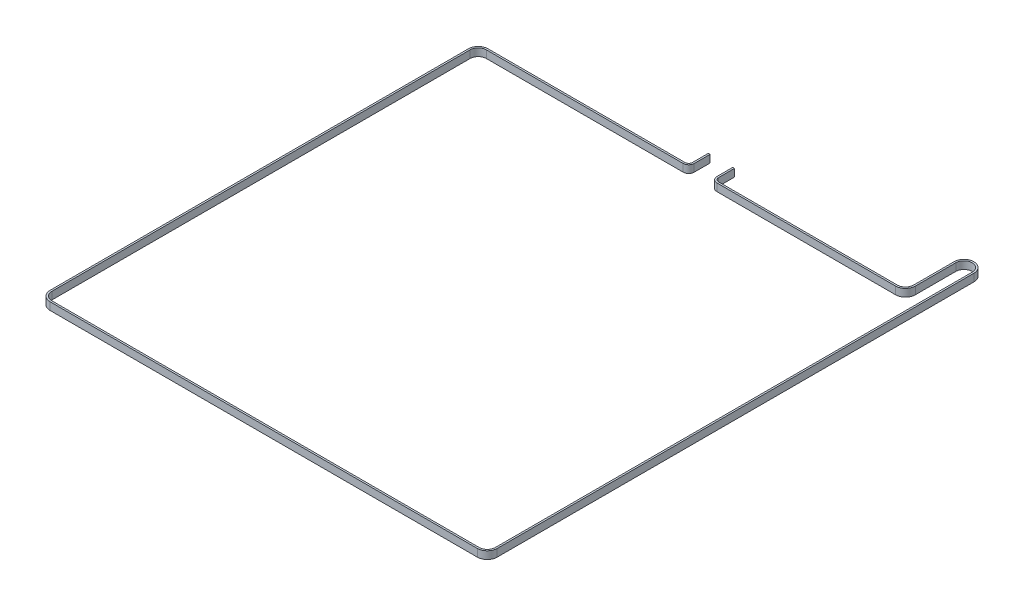
ISO-10303-21;
HEADER;
FILE_DESCRIPTION(('STEP AP214'),'2;1');
FILE_NAME('part.step','',(''),(''),'','','');
FILE_SCHEMA(('AUTOMOTIVE_DESIGN { 1 0 10303 214 1 1 1 1 }'));
ENDSEC;
DATA;
#1=APPLICATION_CONTEXT('core data for automotive mechanical design processes');
#2=APPLICATION_PROTOCOL_DEFINITION('international standard','automotive_design',2000,#1);
#3=PRODUCT_CONTEXT('',#1,'mechanical');
#4=PRODUCT('Part','Part','',(#3));
#5=PRODUCT_RELATED_PRODUCT_CATEGORY('part','',(#4));
#6=PRODUCT_DEFINITION_FORMATION('','',#4);
#7=PRODUCT_DEFINITION_CONTEXT('part definition',#1,'design');
#8=PRODUCT_DEFINITION('design','',#6,#7);
#9=PRODUCT_DEFINITION_SHAPE('','',#8);
#10=(LENGTH_UNIT() NAMED_UNIT(*) SI_UNIT(.MILLI.,.METRE.));
#11=(NAMED_UNIT(*) PLANE_ANGLE_UNIT() SI_UNIT($,.RADIAN.));
#12=(NAMED_UNIT(*) SI_UNIT($,.STERADIAN.) SOLID_ANGLE_UNIT());
#13=UNCERTAINTY_MEASURE_WITH_UNIT(LENGTH_MEASURE(1.E-05),#10,'distance_accuracy_value','');
#14=(GEOMETRIC_REPRESENTATION_CONTEXT(3) GLOBAL_UNCERTAINTY_ASSIGNED_CONTEXT((#13)) GLOBAL_UNIT_ASSIGNED_CONTEXT((#10,
#11,#12)) REPRESENTATION_CONTEXT('',''));
#15=CARTESIAN_POINT('',(0.,0.,0.));
#16=DIRECTION('',(0.,0.,1.));
#17=DIRECTION('',(1.,0.,0.));
#18=AXIS2_PLACEMENT_3D('',#15,#16,#17);
#19=CARTESIAN_POINT('',(-8.97001004794294,-10.0000457504828,119.964412949688));
#20=DIRECTION('',(-6.17863248487036E-13,0.,-1.));
#21=DIRECTION('',(-1.,0.,6.17863248487036E-13));
#22=AXIS2_PLACEMENT_3D('',#19,#20,#21);
#23=PLANE('',#22);
#24=DIRECTION('',(0.,1.,0.));
#25=VECTOR('',#24,1.);
#26=CARTESIAN_POINT('',(-8.97001004793502,-10.0000457504828,119.964412949688));
#27=LINE('',#26,#25);
#28=CARTESIAN_POINT('',(-8.97001004793766,-13.0000457504828,119.964412949688));
#29=VERTEX_POINT('',#28);
#30=CARTESIAN_POINT('',(-8.97001004793766,-7.0000457504828,119.964412949688));
#31=VERTEX_POINT('',#30);
#32=EDGE_CURVE('E314',#29,#31,#27,.T.);
#33=ORIENTED_EDGE('',*,*,#32,.F.);
#34=DIRECTION('',(-1.,0.,6.17863248487036E-13));
#35=VECTOR('',#34,1.);
#36=CARTESIAN_POINT('',(-8.97001004794294,-13.0000457504828,119.964412949688));
#37=LINE('',#36,#35);
#38=CARTESIAN_POINT('',(-10.350010047943,-13.0000457504828,119.964412949689));
#39=VERTEX_POINT('',#38);
#40=EDGE_CURVE('E345',#29,#39,#37,.T.);
#41=ORIENTED_EDGE('',*,*,#40,.T.);
#42=DIRECTION('',(0.,1.,0.));
#43=VECTOR('',#42,1.);
#44=CARTESIAN_POINT('',(-10.350010047943,-10.0000457504828,119.964412949689));
#45=LINE('',#44,#43);
#46=CARTESIAN_POINT('',(-10.350010047943,-7.0000457504828,119.964412949689));
#47=VERTEX_POINT('',#46);
#48=EDGE_CURVE('E311',#47,#39,#45,.F.);
#49=ORIENTED_EDGE('',*,*,#48,.F.);
#50=DIRECTION('',(-1.,0.,6.17863248487036E-13));
#51=VECTOR('',#50,1.);
#52=CARTESIAN_POINT('',(-8.97001004794294,-7.0000457504828,119.964412949688));
#53=LINE('',#52,#51);
#54=EDGE_CURVE('E353',#47,#31,#53,.F.);
#55=ORIENTED_EDGE('',*,*,#54,.T.);
#56=EDGE_LOOP('',(#33,#41,#49,#55));
#57=FACE_BOUND('',#56,.T.);
#58=ADVANCED_FACE('F17',(#57),#23,.T.);
#59=CARTESIAN_POINT('',(10.3499987045161,-10.0000457504828,119.964412949689));
#60=DIRECTION('',(-6.17863248487044E-13,0.,-1.));
#61=DIRECTION('',(-1.,0.,6.17863248487044E-13));
#62=AXIS2_PLACEMENT_3D('',#59,#60,#61);
#63=PLANE('',#62);
#64=DIRECTION('',(0.,1.,0.));
#65=VECTOR('',#64,1.);
#66=CARTESIAN_POINT('',(10.3499987045159,-10.0000457504828,119.964412949689));
#67=LINE('',#66,#65);
#68=CARTESIAN_POINT('',(10.3499987045185,-13.0000457504828,119.964412949689));
#69=VERTEX_POINT('',#68);
#70=CARTESIAN_POINT('',(10.3499987045185,-7.0000457504828,119.964412949689));
#71=VERTEX_POINT('',#70);
#72=EDGE_CURVE('E267',#69,#71,#67,.T.);
#73=ORIENTED_EDGE('',*,*,#72,.F.);
#74=DIRECTION('',(-1.,0.,6.17863248487044E-13));
#75=VECTOR('',#74,1.);
#76=CARTESIAN_POINT('',(10.3499987045161,-13.0000457504828,119.964412949689));
#77=LINE('',#76,#75);
#78=CARTESIAN_POINT('',(8.96999870451613,-13.0000457504828,119.96441294969));
#79=VERTEX_POINT('',#78);
#80=EDGE_CURVE('E336',#69,#79,#77,.T.);
#81=ORIENTED_EDGE('',*,*,#80,.T.);
#82=DIRECTION('',(0.,1.,0.));
#83=VECTOR('',#82,1.);
#84=CARTESIAN_POINT('',(8.96999870451621,-10.0000457504828,119.96441294969));
#85=LINE('',#84,#83);
#86=CARTESIAN_POINT('',(8.96999870451613,-7.0000457504828,119.96441294969));
#87=VERTEX_POINT('',#86);
#88=EDGE_CURVE('E263',#87,#79,#85,.F.);
#89=ORIENTED_EDGE('',*,*,#88,.F.);
#90=DIRECTION('',(-1.,0.,6.17863248487044E-13));
#91=VECTOR('',#90,1.);
#92=CARTESIAN_POINT('',(10.3499987045161,-7.0000457504828,119.964412949689));
#93=LINE('',#92,#91);
#94=EDGE_CURVE('E342',#87,#71,#93,.F.);
#95=ORIENTED_EDGE('',*,*,#94,.T.);
#96=EDGE_LOOP('',(#73,#81,#89,#95));
#97=FACE_BOUND('',#96,.T.);
#98=ADVANCED_FACE('F696',(#97),#63,.T.);
#99=CARTESIAN_POINT('',(-169.379997232066,-10.0000457504828,475.000000000022));
#100=DIRECTION('',(0.,1.,0.));
#101=DIRECTION('',(0.,0.,1.));
#102=AXIS2_PLACEMENT_3D('',#99,#100,#101);
#103=CYLINDRICAL_SURFACE('',#102,6.49999999999999);
#104=CARTESIAN_POINT('',(-169.379997232066,-7.0000457504828,475.000000000022));
#105=DIRECTION('',(0.,1.,0.));
#106=DIRECTION('',(0.,0.,1.));
#107=AXIS2_PLACEMENT_3D('',#104,#105,#106);
#108=CIRCLE('',#107,6.49999999999999);
#109=CARTESIAN_POINT('',(-169.379997232066,-7.0000457504828,481.500000000022));
#110=VERTEX_POINT('',#109);
#111=CARTESIAN_POINT('',(-175.879997232066,-7.0000457504828,475.000000000022));
#112=VERTEX_POINT('',#111);
#113=EDGE_CURVE('E437',#110,#112,#108,.F.);
#114=ORIENTED_EDGE('',*,*,#113,.F.);
#115=DIRECTION('',(0.,1.,0.));
#116=VECTOR('',#115,1.);
#117=CARTESIAN_POINT('',(-169.379997232066,-10.0000457504828,481.500000000022));
#118=LINE('',#117,#116);
#119=CARTESIAN_POINT('',(-169.379997232066,-13.0000457504828,481.500000000022));
#120=VERTEX_POINT('',#119);
#121=EDGE_CURVE('E241',#120,#110,#118,.T.);
#122=ORIENTED_EDGE('',*,*,#121,.F.);
#123=CARTESIAN_POINT('',(-169.379997232066,-13.0000457504828,475.000000000022));
#124=DIRECTION('',(0.,1.,0.));
#125=DIRECTION('',(0.,0.,1.));
#126=AXIS2_PLACEMENT_3D('',#123,#124,#125);
#127=CIRCLE('',#126,6.49999999999999);
#128=CARTESIAN_POINT('',(-175.879997232066,-13.0000457504828,475.000000000022));
#129=VERTEX_POINT('',#128);
#130=EDGE_CURVE('E402',#120,#129,#127,.F.);
#131=ORIENTED_EDGE('',*,*,#130,.T.);
#132=DIRECTION('',(0.,1.,0.));
#133=VECTOR('',#132,1.);
#134=CARTESIAN_POINT('',(-175.879997232066,-10.0000457504828,475.000000000022));
#135=LINE('',#134,#133);
#136=EDGE_CURVE('E334',#112,#129,#135,.F.);
#137=ORIENTED_EDGE('',*,*,#136,.F.);
#138=EDGE_LOOP('',(#114,#122,#131,#137));
#139=FACE_BOUND('',#138,.T.);
#140=ADVANCED_FACE('F693',(#139),#103,.F.);
#141=CARTESIAN_POINT('',(-175.879997232066,-10.0000457504828,475.000000000022));
#142=DIRECTION('',(1.,0.,3.15670613145116E-09));
#143=DIRECTION('',(3.15670613145116E-09,0.,-1.));
#144=AXIS2_PLACEMENT_3D('',#141,#142,#143);
#145=PLANE('',#144);
#146=ORIENTED_EDGE('',*,*,#136,.T.);
#147=DIRECTION('',(0.,0.,1.));
#148=VECTOR('',#147,1.);
#149=CARTESIAN_POINT('',(-175.879997232066,-13.0000457504828,280.999999998365));
#150=LINE('',#149,#148);
#151=CARTESIAN_POINT('',(-175.879996708684,-13.0000457504828,143.400003433195));
#152=VERTEX_POINT('',#151);
#153=EDGE_CURVE('E401',#129,#152,#150,.F.);
#154=ORIENTED_EDGE('',*,*,#153,.T.);
#155=DIRECTION('',(0.,1.,0.));
#156=VECTOR('',#155,1.);
#157=CARTESIAN_POINT('',(-175.879996185302,-10.0000457504828,143.400003433195));
#158=LINE('',#157,#156);
#159=CARTESIAN_POINT('',(-175.879996708684,-7.0000457504828,143.400003433195));
#160=VERTEX_POINT('',#159);
#161=EDGE_CURVE('E331',#152,#160,#158,.T.);
#162=ORIENTED_EDGE('',*,*,#161,.T.);
#163=DIRECTION('',(0.,0.,1.));
#164=VECTOR('',#163,1.);
#165=CARTESIAN_POINT('',(-175.879997232066,-7.0000457504828,280.999999998365));
#166=LINE('',#165,#164);
#167=EDGE_CURVE('E436',#112,#160,#166,.F.);
#168=ORIENTED_EDGE('',*,*,#167,.F.);
#169=EDGE_LOOP('',(#146,#154,#162,#168));
#170=FACE_BOUND('',#169,.T.);
#171=ADVANCED_FACE('F689',(#170),#145,.T.);
#172=CARTESIAN_POINT('',(-169.379996185302,-10.0000457504828,143.400003433195));
#173=DIRECTION('',(0.,1.,0.));
#174=DIRECTION('',(0.,0.,1.));
#175=AXIS2_PLACEMENT_3D('',#172,#173,#174);
#176=CYLINDRICAL_SURFACE('',#175,6.49999999999999);
#177=CARTESIAN_POINT('',(-169.379996185302,-7.0000457504828,143.400003433195));
#178=DIRECTION('',(0.,1.,0.));
#179=DIRECTION('',(0.,0.,1.));
#180=AXIS2_PLACEMENT_3D('',#177,#178,#179);
#181=CIRCLE('',#180,6.49999999999999);
#182=CARTESIAN_POINT('',(-169.379996185302,-7.0000457504828,136.900003433195));
#183=VERTEX_POINT('',#182);
#184=EDGE_CURVE('E432',#160,#183,#181,.F.);
#185=ORIENTED_EDGE('',*,*,#184,.F.);
#186=ORIENTED_EDGE('',*,*,#161,.F.);
#187=CARTESIAN_POINT('',(-169.379996185302,-13.0000457504828,143.400003433195));
#188=DIRECTION('',(0.,1.,0.));
#189=DIRECTION('',(0.,0.,1.));
#190=AXIS2_PLACEMENT_3D('',#187,#188,#189);
#191=CIRCLE('',#190,6.49999999999999);
#192=CARTESIAN_POINT('',(-169.379996185302,-13.0000457504828,136.900003433195));
#193=VERTEX_POINT('',#192);
#194=EDGE_CURVE('E398',#152,#193,#191,.F.);
#195=ORIENTED_EDGE('',*,*,#194,.T.);
#196=DIRECTION('',(0.,1.,0.));
#197=VECTOR('',#196,1.);
#198=CARTESIAN_POINT('',(-169.379996185302,-10.0000457504828,136.900003433195));
#199=LINE('',#198,#197);
#200=EDGE_CURVE('E327',#183,#193,#199,.F.);
#201=ORIENTED_EDGE('',*,*,#200,.F.);
#202=EDGE_LOOP('',(#185,#186,#195,#201));
#203=FACE_BOUND('',#202,.T.);
#204=ADVANCED_FACE('F685',(#203),#176,.F.);
#205=CARTESIAN_POINT('',(-169.379996185302,-10.0000457504828,136.900003433195));
#206=DIRECTION('',(0.,0.,1.));
#207=DIRECTION('',(1.,0.,0.));
#208=AXIS2_PLACEMENT_3D('',#205,#206,#207);
#209=PLANE('',#208);
#210=ORIENTED_EDGE('',*,*,#200,.T.);
#211=DIRECTION('',(1.,0.,0.));
#212=VECTOR('',#211,1.);
#213=CARTESIAN_POINT('',(7.23360926713212E-09,-13.0000457504828,136.900003433195));
#214=LINE('',#213,#212);
#215=CARTESIAN_POINT('',(-13.350010047935,-13.0000457504828,136.900003433195));
#216=VERTEX_POINT('',#215);
#217=EDGE_CURVE('E397',#193,#216,#214,.T.);
#218=ORIENTED_EDGE('',*,*,#217,.T.);
#219=DIRECTION('',(0.,1.,0.));
#220=VECTOR('',#219,1.);
#221=CARTESIAN_POINT('',(-13.350010047935,-10.0000457504828,136.900003433195));
#222=LINE('',#221,#220);
#223=CARTESIAN_POINT('',(-13.350010047935,-7.0000457504828,136.900003433195));
#224=VERTEX_POINT('',#223);
#225=EDGE_CURVE('E320',#224,#216,#222,.F.);
#226=ORIENTED_EDGE('',*,*,#225,.F.);
#227=DIRECTION('',(1.,0.,0.));
#228=VECTOR('',#227,1.);
#229=CARTESIAN_POINT('',(7.23360926713212E-09,-7.0000457504828,136.900003433195));
#230=LINE('',#229,#228);
#231=EDGE_CURVE('E431',#183,#224,#230,.T.);
#232=ORIENTED_EDGE('',*,*,#231,.F.);
#233=EDGE_LOOP('',(#210,#218,#226,#232));
#234=FACE_BOUND('',#233,.T.);
#235=ADVANCED_FACE('F681',(#234),#209,.T.);
#236=CARTESIAN_POINT('',(-13.350010047935,-10.0000457504828,132.520003433195));
#237=DIRECTION('',(0.,1.,0.));
#238=DIRECTION('',(0.,0.,1.));
#239=AXIS2_PLACEMENT_3D('',#236,#237,#238);
#240=CYLINDRICAL_SURFACE('',#239,4.38);
#241=CARTESIAN_POINT('',(-13.350010047935,-13.0000457504828,132.520003433195));
#242=DIRECTION('',(0.,1.,0.));
#243=DIRECTION('',(0.,0.,1.));
#244=AXIS2_PLACEMENT_3D('',#241,#242,#243);
#245=CIRCLE('',#244,4.38);
#246=CARTESIAN_POINT('',(-8.97001004793502,-13.0000457504828,132.520003433195));
#247=VERTEX_POINT('',#246);
#248=EDGE_CURVE('E394',#216,#247,#245,.T.);
#249=ORIENTED_EDGE('',*,*,#248,.T.);
#250=DIRECTION('',(0.,1.,0.));
#251=VECTOR('',#250,1.);
#252=CARTESIAN_POINT('',(-8.97001004793502,-10.0000457504828,132.520003433195));
#253=LINE('',#252,#251);
#254=CARTESIAN_POINT('',(-8.97001004793502,-7.0000457504828,132.520003433195));
#255=VERTEX_POINT('',#254);
#256=EDGE_CURVE('E317',#255,#247,#253,.F.);
#257=ORIENTED_EDGE('',*,*,#256,.F.);
#258=CARTESIAN_POINT('',(-13.350010047935,-7.0000457504828,132.520003433195));
#259=DIRECTION('',(0.,1.,0.));
#260=DIRECTION('',(0.,0.,1.));
#261=AXIS2_PLACEMENT_3D('',#258,#259,#260);
#262=CIRCLE('',#261,4.38);
#263=EDGE_CURVE('E427',#224,#255,#262,.T.);
#264=ORIENTED_EDGE('',*,*,#263,.F.);
#265=ORIENTED_EDGE('',*,*,#225,.T.);
#266=EDGE_LOOP('',(#249,#257,#264,#265));
#267=FACE_BOUND('',#266,.T.);
#268=ADVANCED_FACE('F677',(#267),#240,.T.);
#269=CARTESIAN_POINT('',(-8.97001004793502,-10.0000457504828,136.900003433195));
#270=DIRECTION('',(1.,0.,0.));
#271=DIRECTION('',(0.,0.,-1.));
#272=AXIS2_PLACEMENT_3D('',#269,#270,#271);
#273=PLANE('',#272);
#274=ORIENTED_EDGE('',*,*,#32,.T.);
#275=DIRECTION('',(0.,0.,1.));
#276=VECTOR('',#275,1.);
#277=CARTESIAN_POINT('',(-8.97001004793502,-7.0000457504828,280.999999998365));
#278=LINE('',#277,#276);
#279=EDGE_CURVE('E430',#255,#31,#278,.F.);
#280=ORIENTED_EDGE('',*,*,#279,.F.);
#281=ORIENTED_EDGE('',*,*,#256,.T.);
#282=DIRECTION('',(0.,0.,1.));
#283=VECTOR('',#282,1.);
#284=CARTESIAN_POINT('',(-8.97001004793502,-13.0000457504828,280.999999998365));
#285=LINE('',#284,#283);
#286=EDGE_CURVE('E396',#247,#29,#285,.F.);
#287=ORIENTED_EDGE('',*,*,#286,.T.);
#288=EDGE_LOOP('',(#274,#280,#281,#287));
#289=FACE_BOUND('',#288,.T.);
#290=ADVANCED_FACE('F673',(#289),#273,.T.);
#291=CARTESIAN_POINT('',(-10.350010047943,-10.0000457504828,119.964412949689));
#292=DIRECTION('',(-1.,0.,5.93201140262421E-13));
#293=DIRECTION('',(5.93201140262421E-13,0.,1.));
#294=AXIS2_PLACEMENT_3D('',#291,#292,#293);
#295=PLANE('',#294);
#296=ORIENTED_EDGE('',*,*,#48,.T.);
#297=DIRECTION('',(0.,0.,1.));
#298=VECTOR('',#297,1.);
#299=CARTESIAN_POINT('',(-10.350010047943,-13.0000457504828,280.999999998365));
#300=LINE('',#299,#298);
#301=CARTESIAN_POINT('',(-10.3500100479393,-13.0000457504828,132.520003433194));
#302=VERTEX_POINT('',#301);
#303=EDGE_CURVE('E393',#39,#302,#300,.T.);
#304=ORIENTED_EDGE('',*,*,#303,.T.);
#305=DIRECTION('',(0.,1.,0.));
#306=VECTOR('',#305,1.);
#307=CARTESIAN_POINT('',(-10.3500100479355,-10.0000457504828,132.520003433193));
#308=LINE('',#307,#306);
#309=CARTESIAN_POINT('',(-10.3500100479393,-7.0000457504828,132.520003433194));
#310=VERTEX_POINT('',#309);
#311=EDGE_CURVE('E309',#302,#310,#308,.T.);
#312=ORIENTED_EDGE('',*,*,#311,.T.);
#313=DIRECTION('',(0.,0.,1.));
#314=VECTOR('',#313,1.);
#315=CARTESIAN_POINT('',(-10.350010047943,-7.0000457504828,280.999999998365));
#316=LINE('',#315,#314);
#317=EDGE_CURVE('E426',#47,#310,#316,.T.);
#318=ORIENTED_EDGE('',*,*,#317,.F.);
#319=EDGE_LOOP('',(#296,#304,#312,#318));
#320=FACE_BOUND('',#319,.T.);
#321=ADVANCED_FACE('F669',(#320),#295,.T.);
#322=CARTESIAN_POINT('',(-13.3500100479355,-10.0000457504828,132.520003433195));
#323=DIRECTION('',(0.,1.,0.));
#324=DIRECTION('',(0.,0.,1.));
#325=AXIS2_PLACEMENT_3D('',#322,#323,#324);
#326=CYLINDRICAL_SURFACE('',#325,3.);
#327=DIRECTION('',(0.,1.,0.));
#328=VECTOR('',#327,1.);
#329=CARTESIAN_POINT('',(-13.3500100479355,-10.0000457504828,135.520003433195));
#330=LINE('',#329,#328);
#331=CARTESIAN_POINT('',(-13.3500100479355,-7.0000457504828,135.520003433195));
#332=VERTEX_POINT('',#331);
#333=CARTESIAN_POINT('',(-13.3500100479355,-13.0000457504828,135.520003433195));
#334=VERTEX_POINT('',#333);
#335=EDGE_CURVE('E306',#332,#334,#330,.F.);
#336=ORIENTED_EDGE('',*,*,#335,.F.);
#337=CARTESIAN_POINT('',(-13.3500100479355,-7.0000457504828,132.520003433195));
#338=DIRECTION('',(0.,1.,0.));
#339=DIRECTION('',(0.,0.,1.));
#340=AXIS2_PLACEMENT_3D('',#337,#338,#339);
#341=CIRCLE('',#340,3.);
#342=EDGE_CURVE('E423',#310,#332,#341,.F.);
#343=ORIENTED_EDGE('',*,*,#342,.F.);
#344=ORIENTED_EDGE('',*,*,#311,.F.);
#345=CARTESIAN_POINT('',(-13.3500100479355,-13.0000457504828,132.520003433195));
#346=DIRECTION('',(0.,1.,0.));
#347=DIRECTION('',(0.,0.,1.));
#348=AXIS2_PLACEMENT_3D('',#345,#346,#347);
#349=CIRCLE('',#348,3.);
#350=EDGE_CURVE('E391',#302,#334,#349,.F.);
#351=ORIENTED_EDGE('',*,*,#350,.T.);
#352=EDGE_LOOP('',(#336,#343,#344,#351));
#353=FACE_BOUND('',#352,.T.);
#354=ADVANCED_FACE('F665',(#353),#326,.F.);
#355=CARTESIAN_POINT('',(-10.3500100479338,-10.0000457504828,135.520003433195));
#356=DIRECTION('',(0.,0.,-1.));
#357=DIRECTION('',(-1.,0.,0.));
#358=AXIS2_PLACEMENT_3D('',#355,#356,#357);
#359=PLANE('',#358);
#360=DIRECTION('',(0.,1.,0.));
#361=VECTOR('',#360,1.);
#362=CARTESIAN_POINT('',(-169.379996185302,-10.0000457504828,135.520003433195));
#363=LINE('',#362,#361);
#364=CARTESIAN_POINT('',(-169.379996185302,-7.0000457504828,135.520003433195));
#365=VERTEX_POINT('',#364);
#366=CARTESIAN_POINT('',(-169.379996185302,-13.0000457504828,135.520003433195));
#367=VERTEX_POINT('',#366);
#368=EDGE_CURVE('E302',#365,#367,#363,.F.);
#369=ORIENTED_EDGE('',*,*,#368,.F.);
#370=DIRECTION('',(1.,0.,0.));
#371=VECTOR('',#370,1.);
#372=CARTESIAN_POINT('',(7.23360926713212E-09,-7.0000457504828,135.520003433195));
#373=LINE('',#372,#371);
#374=EDGE_CURVE('E422',#332,#365,#373,.F.);
#375=ORIENTED_EDGE('',*,*,#374,.F.);
#376=ORIENTED_EDGE('',*,*,#335,.T.);
#377=DIRECTION('',(1.,0.,0.));
#378=VECTOR('',#377,1.);
#379=CARTESIAN_POINT('',(7.23360926713212E-09,-13.0000457504828,135.520003433195));
#380=LINE('',#379,#378);
#381=EDGE_CURVE('E390',#334,#367,#380,.F.);
#382=ORIENTED_EDGE('',*,*,#381,.T.);
#383=EDGE_LOOP('',(#369,#375,#376,#382));
#384=FACE_BOUND('',#383,.T.);
#385=ADVANCED_FACE('F661',(#384),#359,.T.);
#386=CARTESIAN_POINT('',(-169.379996185302,-10.0000457504828,143.400003433195));
#387=DIRECTION('',(0.,1.,0.));
#388=DIRECTION('',(0.,0.,1.));
#389=AXIS2_PLACEMENT_3D('',#386,#387,#388);
#390=CYLINDRICAL_SURFACE('',#389,7.87999999999997);
#391=ORIENTED_EDGE('',*,*,#368,.T.);
#392=CARTESIAN_POINT('',(-169.379996185302,-13.0000457504828,143.400003433195));
#393=DIRECTION('',(0.,1.,0.));
#394=DIRECTION('',(0.,0.,1.));
#395=AXIS2_PLACEMENT_3D('',#392,#393,#394);
#396=CIRCLE('',#395,7.87999999999997);
#397=CARTESIAN_POINT('',(-177.259996185302,-13.0000457504828,143.400003420758));
#398=VERTEX_POINT('',#397);
#399=EDGE_CURVE('E387',#367,#398,#396,.T.);
#400=ORIENTED_EDGE('',*,*,#399,.T.);
#401=DIRECTION('',(0.,1.,0.));
#402=VECTOR('',#401,1.);
#403=CARTESIAN_POINT('',(-177.259996185302,-10.0000457504828,143.40000340832));
#404=LINE('',#403,#402);
#405=CARTESIAN_POINT('',(-177.259996185302,-7.0000457504828,143.400003420758));
#406=VERTEX_POINT('',#405);
#407=EDGE_CURVE('E298',#406,#398,#404,.F.);
#408=ORIENTED_EDGE('',*,*,#407,.F.);
#409=CARTESIAN_POINT('',(-169.379996185302,-7.0000457504828,143.400003433195));
#410=DIRECTION('',(0.,1.,0.));
#411=DIRECTION('',(0.,0.,1.));
#412=AXIS2_PLACEMENT_3D('',#409,#410,#411);
#413=CIRCLE('',#412,7.87999999999997);
#414=EDGE_CURVE('E418',#365,#406,#413,.T.);
#415=ORIENTED_EDGE('',*,*,#414,.F.);
#416=EDGE_LOOP('',(#391,#400,#408,#415));
#417=FACE_BOUND('',#416,.T.);
#418=ADVANCED_FACE('F657',(#417),#390,.T.);
#419=CARTESIAN_POINT('',(-177.259996185302,-10.0000457504828,143.40000340832));
#420=DIRECTION('',(-1.,0.,-3.15670613145116E-09));
#421=DIRECTION('',(-3.15670613145116E-09,0.,1.));
#422=AXIS2_PLACEMENT_3D('',#419,#420,#421);
#423=PLANE('',#422);
#424=ORIENTED_EDGE('',*,*,#407,.T.);
#425=DIRECTION('',(0.,0.,1.));
#426=VECTOR('',#425,1.);
#427=CARTESIAN_POINT('',(-177.259996185302,-13.0000457504828,280.999999998365));
#428=LINE('',#427,#426);
#429=CARTESIAN_POINT('',(-177.259996708684,-13.0000457504828,474.999999987584));
#430=VERTEX_POINT('',#429);
#431=EDGE_CURVE('E386',#398,#430,#428,.T.);
#432=ORIENTED_EDGE('',*,*,#431,.T.);
#433=DIRECTION('',(0.,1.,0.));
#434=VECTOR('',#433,1.);
#435=CARTESIAN_POINT('',(-177.259997232066,-10.0000457504828,474.999999975147));
#436=LINE('',#435,#434);
#437=CARTESIAN_POINT('',(-177.259996708684,-7.0000457504828,474.999999987584));
#438=VERTEX_POINT('',#437);
#439=EDGE_CURVE('E295',#438,#430,#436,.F.);
#440=ORIENTED_EDGE('',*,*,#439,.F.);
#441=DIRECTION('',(0.,0.,1.));
#442=VECTOR('',#441,1.);
#443=CARTESIAN_POINT('',(-177.259996185302,-7.0000457504828,280.999999998365));
#444=LINE('',#443,#442);
#445=EDGE_CURVE('E417',#406,#438,#444,.T.);
#446=ORIENTED_EDGE('',*,*,#445,.F.);
#447=EDGE_LOOP('',(#424,#432,#440,#446));
#448=FACE_BOUND('',#447,.T.);
#449=ADVANCED_FACE('F653',(#448),#423,.T.);
#450=CARTESIAN_POINT('',(-169.379997232066,-10.0000457504828,475.000000000022));
#451=DIRECTION('',(0.,1.,0.));
#452=DIRECTION('',(0.,0.,1.));
#453=AXIS2_PLACEMENT_3D('',#450,#451,#452);
#454=CYLINDRICAL_SURFACE('',#453,7.87999999999997);
#455=ORIENTED_EDGE('',*,*,#439,.T.);
#456=CARTESIAN_POINT('',(-169.379997232066,-13.0000457504828,475.000000000022));
#457=DIRECTION('',(0.,1.,0.));
#458=DIRECTION('',(0.,0.,1.));
#459=AXIS2_PLACEMENT_3D('',#456,#457,#458);
#460=CIRCLE('',#459,7.87999999999997);
#461=CARTESIAN_POINT('',(-169.379997232066,-13.0000457504828,482.880000000022));
#462=VERTEX_POINT('',#461);
#463=EDGE_CURVE('E384',#430,#462,#460,.T.);
#464=ORIENTED_EDGE('',*,*,#463,.T.);
#465=DIRECTION('',(0.,1.,0.));
#466=VECTOR('',#465,1.);
#467=CARTESIAN_POINT('',(-169.379997232066,-10.0000457504828,482.880000000022));
#468=LINE('',#467,#466);
#469=CARTESIAN_POINT('',(-169.379997232066,-7.0000457504828,482.880000000022));
#470=VERTEX_POINT('',#469);
#471=EDGE_CURVE('E292',#470,#462,#468,.F.);
#472=ORIENTED_EDGE('',*,*,#471,.F.);
#473=CARTESIAN_POINT('',(-169.379997232066,-7.0000457504828,475.000000000022));
#474=DIRECTION('',(0.,1.,0.));
#475=DIRECTION('',(0.,0.,1.));
#476=AXIS2_PLACEMENT_3D('',#473,#474,#475);
#477=CIRCLE('',#476,7.87999999999997);
#478=EDGE_CURVE('E414',#438,#470,#477,.T.);
#479=ORIENTED_EDGE('',*,*,#478,.F.);
#480=EDGE_LOOP('',(#455,#464,#472,#479));
#481=FACE_BOUND('',#480,.T.);
#482=ADVANCED_FACE('F649',(#481),#454,.T.);
#483=CARTESIAN_POINT('',(-169.379997232066,-10.0000457504828,482.880000000022));
#484=DIRECTION('',(0.,0.,1.));
#485=DIRECTION('',(1.,0.,0.));
#486=AXIS2_PLACEMENT_3D('',#483,#484,#485);
#487=PLANE('',#486);
#488=ORIENTED_EDGE('',*,*,#471,.T.);
#489=DIRECTION('',(1.,0.,0.));
#490=VECTOR('',#489,1.);
#491=CARTESIAN_POINT('',(7.23360926713212E-09,-13.0000457504828,482.880000000022));
#492=LINE('',#491,#490);
#493=CARTESIAN_POINT('',(169.379997246531,-13.0000457504828,482.880000000022));
#494=VERTEX_POINT('',#493);
#495=EDGE_CURVE('E383',#462,#494,#492,.T.);
#496=ORIENTED_EDGE('',*,*,#495,.T.);
#497=DIRECTION('',(0.,1.,0.));
#498=VECTOR('',#497,1.);
#499=CARTESIAN_POINT('',(169.379997246531,-10.0000457504828,482.880000000022));
#500=LINE('',#499,#498);
#501=CARTESIAN_POINT('',(169.379997246531,-7.0000457504828,482.880000000022));
#502=VERTEX_POINT('',#501);
#503=EDGE_CURVE('E289',#502,#494,#500,.F.);
#504=ORIENTED_EDGE('',*,*,#503,.F.);
#505=DIRECTION('',(1.,0.,0.));
#506=VECTOR('',#505,1.);
#507=CARTESIAN_POINT('',(7.23360926713212E-09,-7.0000457504828,482.880000000022));
#508=LINE('',#507,#506);
#509=EDGE_CURVE('E413',#470,#502,#508,.T.);
#510=ORIENTED_EDGE('',*,*,#509,.F.);
#511=EDGE_LOOP('',(#488,#496,#504,#510));
#512=FACE_BOUND('',#511,.T.);
#513=ADVANCED_FACE('F645',(#512),#487,.T.);
#514=CARTESIAN_POINT('',(169.379997246531,-10.0000457504828,475.00000000002));
#515=DIRECTION('',(0.,1.,0.));
#516=DIRECTION('',(0.,0.,1.));
#517=AXIS2_PLACEMENT_3D('',#514,#515,#516);
#518=CYLINDRICAL_SURFACE('',#517,7.88000000000198);
#519=ORIENTED_EDGE('',*,*,#503,.T.);
#520=CARTESIAN_POINT('',(169.379997246531,-13.0000457504828,475.00000000002));
#521=DIRECTION('',(0.,1.,0.));
#522=DIRECTION('',(0.,0.,1.));
#523=AXIS2_PLACEMENT_3D('',#520,#521,#522);
#524=CIRCLE('',#523,7.88000000000198);
#525=CARTESIAN_POINT('',(177.259997246532,-13.0000457504828,475.00000000002));
#526=VERTEX_POINT('',#525);
#527=EDGE_CURVE('E381',#494,#526,#524,.T.);
#528=ORIENTED_EDGE('',*,*,#527,.T.);
#529=DIRECTION('',(0.,1.,0.));
#530=VECTOR('',#529,1.);
#531=CARTESIAN_POINT('',(177.259997246531,-10.0000457504828,475.00000000002));
#532=LINE('',#531,#530);
#533=CARTESIAN_POINT('',(177.259997246532,-7.0000457504828,475.00000000002));
#534=VERTEX_POINT('',#533);
#535=EDGE_CURVE('E286',#534,#526,#532,.F.);
#536=ORIENTED_EDGE('',*,*,#535,.F.);
#537=CARTESIAN_POINT('',(169.379997246531,-7.0000457504828,475.00000000002));
#538=DIRECTION('',(0.,1.,0.));
#539=DIRECTION('',(0.,0.,1.));
#540=AXIS2_PLACEMENT_3D('',#537,#538,#539);
#541=CIRCLE('',#540,7.88000000000198);
#542=EDGE_CURVE('E410',#502,#534,#541,.T.);
#543=ORIENTED_EDGE('',*,*,#542,.F.);
#544=EDGE_LOOP('',(#519,#528,#536,#543));
#545=FACE_BOUND('',#544,.T.);
#546=ADVANCED_FACE('F641',(#545),#518,.T.);
#547=CARTESIAN_POINT('',(177.259997246531,-10.0000457504828,485.00000000002));
#548=DIRECTION('',(1.,0.,0.));
#549=DIRECTION('',(0.,0.,-1.));
#550=AXIS2_PLACEMENT_3D('',#547,#548,#549);
#551=PLANE('',#550);
#552=DIRECTION('',(0.,0.,1.));
#553=VECTOR('',#552,1.);
#554=CARTESIAN_POINT('',(177.259997246533,-7.0000457504828,280.999999998365));
#555=LINE('',#554,#553);
#556=CARTESIAN_POINT('',(177.259997246532,-7.0000457504828,97.0000000000005));
#557=VERTEX_POINT('',#556);
#558=EDGE_CURVE('E409',#534,#557,#555,.F.);
#559=ORIENTED_EDGE('',*,*,#558,.F.);
#560=ORIENTED_EDGE('',*,*,#535,.T.);
#561=DIRECTION('',(0.,0.,1.));
#562=VECTOR('',#561,1.);
#563=CARTESIAN_POINT('',(177.259997246533,-13.0000457504828,280.999999998365));
#564=LINE('',#563,#562);
#565=CARTESIAN_POINT('',(177.259997246532,-13.0000457504828,97.0000000000005));
#566=VERTEX_POINT('',#565);
#567=EDGE_CURVE('E380',#526,#566,#564,.F.);
#568=ORIENTED_EDGE('',*,*,#567,.T.);
#569=DIRECTION('',(0.,1.,0.));
#570=VECTOR('',#569,1.);
#571=CARTESIAN_POINT('',(177.259997246531,-10.0000457504828,97.0000000000005));
#572=LINE('',#571,#570);
#573=EDGE_CURVE('E283',#557,#566,#572,.F.);
#574=ORIENTED_EDGE('',*,*,#573,.F.);
#575=EDGE_LOOP('',(#559,#560,#568,#574));
#576=FACE_BOUND('',#575,.T.);
#577=ADVANCED_FACE('F637',(#576),#551,.T.);
#578=CARTESIAN_POINT('',(169.379997243239,-10.0000457504828,97.0000000000005));
#579=DIRECTION('',(0.,1.,0.));
#580=DIRECTION('',(0.,0.,1.));
#581=AXIS2_PLACEMENT_3D('',#578,#579,#580);
#582=CYLINDRICAL_SURFACE('',#581,7.88000000329173);
#583=ORIENTED_EDGE('',*,*,#573,.T.);
#584=CARTESIAN_POINT('',(169.379997243239,-13.0000457504828,97.0000000000005));
#585=DIRECTION('',(0.,1.,0.));
#586=DIRECTION('',(0.,0.,1.));
#587=AXIS2_PLACEMENT_3D('',#584,#585,#586);
#588=CIRCLE('',#587,7.88000000329173);
#589=CARTESIAN_POINT('',(161.499997114454,-13.0000457504828,96.9999998983107));
#590=VERTEX_POINT('',#589);
#591=EDGE_CURVE('E378',#566,#590,#588,.T.);
#592=ORIENTED_EDGE('',*,*,#591,.T.);
#593=DIRECTION('',(0.,1.,0.));
#594=VECTOR('',#593,1.);
#595=CARTESIAN_POINT('',(161.499996988961,-10.0000457504828,96.999999796621));
#596=LINE('',#595,#594);
#597=CARTESIAN_POINT('',(161.499997114454,-7.0000457504828,96.9999998983107));
#598=VERTEX_POINT('',#597);
#599=EDGE_CURVE('E280',#598,#590,#596,.F.);
#600=ORIENTED_EDGE('',*,*,#599,.F.);
#601=CARTESIAN_POINT('',(169.379997243239,-7.0000457504828,97.0000000000005));
#602=DIRECTION('',(0.,1.,0.));
#603=DIRECTION('',(0.,0.,1.));
#604=AXIS2_PLACEMENT_3D('',#601,#602,#603);
#605=CIRCLE('',#604,7.88000000329173);
#606=EDGE_CURVE('E341',#557,#598,#605,.T.);
#607=ORIENTED_EDGE('',*,*,#606,.F.);
#608=EDGE_LOOP('',(#583,#592,#600,#607));
#609=FACE_BOUND('',#608,.T.);
#610=ADVANCED_FACE('F634',(#609),#582,.T.);
#611=CARTESIAN_POINT('',(161.499997239947,-10.0000457504828,86.9999998022233));
#612=DIRECTION('',(-1.,0.,-2.50986366447968E-08));
#613=DIRECTION('',(-2.50986366447968E-08,0.,1.));
#614=AXIS2_PLACEMENT_3D('',#611,#612,#613);
#615=PLANE('',#614);
#616=DIRECTION('',(0.,0.,1.));
#617=VECTOR('',#616,1.);
#618=CARTESIAN_POINT('',(161.499997239947,-7.0000457504828,280.999999998365));
#619=LINE('',#618,#617);
#620=CARTESIAN_POINT('',(161.499996712625,-7.0000457504828,129.020003514766));
#621=VERTEX_POINT('',#620);
#622=EDGE_CURVE('E240',#598,#621,#619,.T.);
#623=ORIENTED_EDGE('',*,*,#622,.F.);
#624=ORIENTED_EDGE('',*,*,#599,.T.);
#625=DIRECTION('',(0.,0.,1.));
#626=VECTOR('',#625,1.);
#627=CARTESIAN_POINT('',(161.499997239947,-13.0000457504828,280.999999998365));
#628=LINE('',#627,#626);
#629=CARTESIAN_POINT('',(161.499996712625,-13.0000457504828,129.020003514766));
#630=VERTEX_POINT('',#629);
#631=EDGE_CURVE('E377',#590,#630,#628,.T.);
#632=ORIENTED_EDGE('',*,*,#631,.T.);
#633=DIRECTION('',(0.,1.,0.));
#634=VECTOR('',#633,1.);
#635=CARTESIAN_POINT('',(161.499996185303,-10.0000457504828,129.020003596336));
#636=LINE('',#635,#634);
#637=EDGE_CURVE('E211',#630,#621,#636,.T.);
#638=ORIENTED_EDGE('',*,*,#637,.T.);
#639=EDGE_LOOP('',(#623,#624,#632,#638));
#640=FACE_BOUND('',#639,.T.);
#641=ADVANCED_FACE('F631',(#640),#615,.T.);
#642=CARTESIAN_POINT('',(154.999996185303,-10.0000457504828,129.020003433195));
#643=DIRECTION('',(0.,1.,0.));
#644=DIRECTION('',(0.,0.,1.));
#645=AXIS2_PLACEMENT_3D('',#642,#643,#644);
#646=CYLINDRICAL_SURFACE('',#645,6.49999999999999);
#647=CARTESIAN_POINT('',(154.999996185303,-7.0000457504828,129.020003433195));
#648=DIRECTION('',(0.,1.,0.));
#649=DIRECTION('',(0.,0.,1.));
#650=AXIS2_PLACEMENT_3D('',#647,#648,#649);
#651=CIRCLE('',#650,6.49999999999999);
#652=CARTESIAN_POINT('',(154.999996185303,-7.0000457504828,135.520003433195));
#653=VERTEX_POINT('',#652);
#654=EDGE_CURVE('E20',#621,#653,#651,.F.);
#655=ORIENTED_EDGE('',*,*,#654,.F.);
#656=ORIENTED_EDGE('',*,*,#637,.F.);
#657=CARTESIAN_POINT('',(154.999996185303,-13.0000457504828,129.020003433195));
#658=DIRECTION('',(0.,1.,0.));
#659=DIRECTION('',(0.,0.,1.));
#660=AXIS2_PLACEMENT_3D('',#657,#658,#659);
#661=CIRCLE('',#660,6.49999999999999);
#662=CARTESIAN_POINT('',(154.999996185303,-13.0000457504828,135.520003433195));
#663=VERTEX_POINT('',#662);
#664=EDGE_CURVE('E222',#630,#663,#661,.F.);
#665=ORIENTED_EDGE('',*,*,#664,.T.);
#666=DIRECTION('',(0.,1.,0.));
#667=VECTOR('',#666,1.);
#668=CARTESIAN_POINT('',(154.999996185303,-10.0000457504828,135.520003433195));
#669=LINE('',#668,#667);
#670=EDGE_CURVE('E216',#653,#663,#669,.F.);
#671=ORIENTED_EDGE('',*,*,#670,.F.);
#672=EDGE_LOOP('',(#655,#656,#665,#671));
#673=FACE_BOUND('',#672,.T.);
#674=ADVANCED_FACE('F218',(#673),#646,.F.);
#675=CARTESIAN_POINT('',(154.999996185303,-10.0000457504828,135.520003433195));
#676=DIRECTION('',(0.,0.,-1.));
#677=DIRECTION('',(-1.,0.,0.));
#678=AXIS2_PLACEMENT_3D('',#675,#676,#677);
#679=PLANE('',#678);
#680=ORIENTED_EDGE('',*,*,#670,.T.);
#681=DIRECTION('',(1.,0.,0.));
#682=VECTOR('',#681,1.);
#683=CARTESIAN_POINT('',(7.23360926713212E-09,-13.0000457504828,135.520003433195));
#684=LINE('',#683,#682);
#685=CARTESIAN_POINT('',(13.3499987045236,-13.0000457504828,135.520003433195));
#686=VERTEX_POINT('',#685);
#687=EDGE_CURVE('E375',#663,#686,#684,.F.);
#688=ORIENTED_EDGE('',*,*,#687,.T.);
#689=DIRECTION('',(0.,1.,0.));
#690=VECTOR('',#689,1.);
#691=CARTESIAN_POINT('',(13.3499987045236,-10.0000457504828,135.520003433195));
#692=LINE('',#691,#690);
#693=CARTESIAN_POINT('',(13.3499987045236,-7.0000457504828,135.520003433195));
#694=VERTEX_POINT('',#693);
#695=EDGE_CURVE('E225',#686,#694,#692,.T.);
#696=ORIENTED_EDGE('',*,*,#695,.T.);
#697=DIRECTION('',(1.,0.,0.));
#698=VECTOR('',#697,1.);
#699=CARTESIAN_POINT('',(7.23360926713212E-09,-7.0000457504828,135.520003433195));
#700=LINE('',#699,#698);
#701=EDGE_CURVE('E228',#653,#694,#700,.F.);
#702=ORIENTED_EDGE('',*,*,#701,.F.);
#703=EDGE_LOOP('',(#680,#688,#696,#702));
#704=FACE_BOUND('',#703,.T.);
#705=ADVANCED_FACE('F229',(#704),#679,.T.);
#706=CARTESIAN_POINT('',(13.3499987045236,-10.0000457504828,132.520003433195));
#707=DIRECTION('',(0.,1.,0.));
#708=DIRECTION('',(0.,0.,1.));
#709=AXIS2_PLACEMENT_3D('',#706,#707,#708);
#710=CYLINDRICAL_SURFACE('',#709,3.);
#711=DIRECTION('',(0.,1.,0.));
#712=VECTOR('',#711,1.);
#713=CARTESIAN_POINT('',(10.3499987045236,-10.0000457504828,132.520003433197));
#714=LINE('',#713,#712);
#715=CARTESIAN_POINT('',(10.3499987045236,-7.0000457504828,132.520003433196));
#716=VERTEX_POINT('',#715);
#717=CARTESIAN_POINT('',(10.3499987045236,-13.0000457504828,132.520003433196));
#718=VERTEX_POINT('',#717);
#719=EDGE_CURVE('E270',#716,#718,#714,.F.);
#720=ORIENTED_EDGE('',*,*,#719,.F.);
#721=CARTESIAN_POINT('',(13.3499987045236,-7.0000457504828,132.520003433195));
#722=DIRECTION('',(0.,1.,0.));
#723=DIRECTION('',(0.,0.,1.));
#724=AXIS2_PLACEMENT_3D('',#721,#722,#723);
#725=CIRCLE('',#724,3.);
#726=EDGE_CURVE('E235',#694,#716,#725,.F.);
#727=ORIENTED_EDGE('',*,*,#726,.F.);
#728=ORIENTED_EDGE('',*,*,#695,.F.);
#729=CARTESIAN_POINT('',(13.3499987045236,-13.0000457504828,132.520003433195));
#730=DIRECTION('',(0.,1.,0.));
#731=DIRECTION('',(0.,0.,1.));
#732=AXIS2_PLACEMENT_3D('',#729,#730,#731);
#733=CIRCLE('',#732,3.);
#734=EDGE_CURVE('E372',#686,#718,#733,.F.);
#735=ORIENTED_EDGE('',*,*,#734,.T.);
#736=EDGE_LOOP('',(#720,#727,#728,#735));
#737=FACE_BOUND('',#736,.T.);
#738=ADVANCED_FACE('F622',(#737),#710,.F.);
#739=CARTESIAN_POINT('',(10.3499987045254,-10.0000457504828,135.520003433195));
#740=DIRECTION('',(1.,0.,-6.07902340189988E-13));
#741=DIRECTION('',(-6.07902340189988E-13,0.,-1.));
#742=AXIS2_PLACEMENT_3D('',#739,#740,#741);
#743=PLANE('',#742);
#744=ORIENTED_EDGE('',*,*,#72,.T.);
#745=DIRECTION('',(0.,0.,1.));
#746=VECTOR('',#745,1.);
#747=CARTESIAN_POINT('',(10.3499987045236,-7.0000457504828,280.999999998365));
#748=LINE('',#747,#746);
#749=EDGE_CURVE('E449',#716,#71,#748,.F.);
#750=ORIENTED_EDGE('',*,*,#749,.F.);
#751=ORIENTED_EDGE('',*,*,#719,.T.);
#752=DIRECTION('',(0.,0.,1.));
#753=VECTOR('',#752,1.);
#754=CARTESIAN_POINT('',(10.3499987045236,-13.0000457504828,280.999999998365));
#755=LINE('',#754,#753);
#756=EDGE_CURVE('E374',#718,#69,#755,.F.);
#757=ORIENTED_EDGE('',*,*,#756,.T.);
#758=EDGE_LOOP('',(#744,#750,#751,#757));
#759=FACE_BOUND('',#758,.T.);
#760=ADVANCED_FACE('F619',(#759),#743,.T.);
#761=CARTESIAN_POINT('',(8.96999870451621,-10.0000457504828,119.96441294969));
#762=DIRECTION('',(-1.,0.,5.86371018931052E-13));
#763=DIRECTION('',(5.86371018931052E-13,0.,1.));
#764=AXIS2_PLACEMENT_3D('',#761,#762,#763);
#765=PLANE('',#764);
#766=ORIENTED_EDGE('',*,*,#88,.T.);
#767=DIRECTION('',(0.,0.,1.));
#768=VECTOR('',#767,1.);
#769=CARTESIAN_POINT('',(8.96999870451609,-13.0000457504828,280.999999998365));
#770=LINE('',#769,#768);
#771=CARTESIAN_POINT('',(8.96999870451985,-13.0000457504828,132.520003433197));
#772=VERTEX_POINT('',#771);
#773=EDGE_CURVE('E371',#79,#772,#770,.T.);
#774=ORIENTED_EDGE('',*,*,#773,.T.);
#775=DIRECTION('',(0.,1.,0.));
#776=VECTOR('',#775,1.);
#777=CARTESIAN_POINT('',(8.9699987045236,-10.0000457504828,132.520003433198));
#778=LINE('',#777,#776);
#779=CARTESIAN_POINT('',(8.96999870451985,-7.0000457504828,132.520003433197));
#780=VERTEX_POINT('',#779);
#781=EDGE_CURVE('E260',#780,#772,#778,.F.);
#782=ORIENTED_EDGE('',*,*,#781,.F.);
#783=DIRECTION('',(0.,0.,1.));
#784=VECTOR('',#783,1.);
#785=CARTESIAN_POINT('',(8.96999870451609,-7.0000457504828,280.999999998365));
#786=LINE('',#785,#784);
#787=EDGE_CURVE('E448',#87,#780,#786,.T.);
#788=ORIENTED_EDGE('',*,*,#787,.F.);
#789=EDGE_LOOP('',(#766,#774,#782,#788));
#790=FACE_BOUND('',#789,.T.);
#791=ADVANCED_FACE('F562',(#790),#765,.T.);
#792=CARTESIAN_POINT('',(13.3499987045236,-10.0000457504828,132.520003433195));
#793=DIRECTION('',(0.,1.,0.));
#794=DIRECTION('',(0.,0.,1.));
#795=AXIS2_PLACEMENT_3D('',#792,#793,#794);
#796=CYLINDRICAL_SURFACE('',#795,4.38);
#797=CARTESIAN_POINT('',(13.3499987045236,-13.0000457504828,132.520003433195));
#798=DIRECTION('',(0.,1.,0.));
#799=DIRECTION('',(0.,0.,1.));
#800=AXIS2_PLACEMENT_3D('',#797,#798,#799);
#801=CIRCLE('',#800,4.38);
#802=CARTESIAN_POINT('',(13.3499987045236,-13.0000457504828,136.900003433195));
#803=VERTEX_POINT('',#802);
#804=EDGE_CURVE('E369',#772,#803,#801,.T.);
#805=ORIENTED_EDGE('',*,*,#804,.T.);
#806=DIRECTION('',(0.,1.,0.));
#807=VECTOR('',#806,1.);
#808=CARTESIAN_POINT('',(13.3499987045236,-10.0000457504828,136.900003433195));
#809=LINE('',#808,#807);
#810=CARTESIAN_POINT('',(13.3499987045236,-7.0000457504828,136.900003433195));
#811=VERTEX_POINT('',#810);
#812=EDGE_CURVE('E257',#811,#803,#809,.F.);
#813=ORIENTED_EDGE('',*,*,#812,.F.);
#814=CARTESIAN_POINT('',(13.3499987045236,-7.0000457504828,132.520003433195));
#815=DIRECTION('',(0.,1.,0.));
#816=DIRECTION('',(0.,0.,1.));
#817=AXIS2_PLACEMENT_3D('',#814,#815,#816);
#818=CIRCLE('',#817,4.38);
#819=EDGE_CURVE('E446',#780,#811,#818,.T.);
#820=ORIENTED_EDGE('',*,*,#819,.F.);
#821=ORIENTED_EDGE('',*,*,#781,.T.);
#822=EDGE_LOOP('',(#805,#813,#820,#821));
#823=FACE_BOUND('',#822,.T.);
#824=ADVANCED_FACE('F559',(#823),#796,.T.);
#825=CARTESIAN_POINT('',(8.96999870452614,-10.0000457504828,136.900003433195));
#826=DIRECTION('',(0.,0.,1.));
#827=DIRECTION('',(1.,0.,0.));
#828=AXIS2_PLACEMENT_3D('',#825,#826,#827);
#829=PLANE('',#828);
#830=DIRECTION('',(0.,1.,0.));
#831=VECTOR('',#830,1.);
#832=CARTESIAN_POINT('',(154.999996185303,-10.0000457504828,136.900003433195));
#833=LINE('',#832,#831);
#834=CARTESIAN_POINT('',(154.999996185303,-7.0000457504828,136.900003433195));
#835=VERTEX_POINT('',#834);
#836=CARTESIAN_POINT('',(154.999996185303,-13.0000457504828,136.900003433195));
#837=VERTEX_POINT('',#836);
#838=EDGE_CURVE('E254',#835,#837,#833,.F.);
#839=ORIENTED_EDGE('',*,*,#838,.F.);
#840=DIRECTION('',(1.,0.,0.));
#841=VECTOR('',#840,1.);
#842=CARTESIAN_POINT('',(7.23360926713212E-09,-7.0000457504828,136.900003433195));
#843=LINE('',#842,#841);
#844=EDGE_CURVE('E445',#811,#835,#843,.T.);
#845=ORIENTED_EDGE('',*,*,#844,.F.);
#846=ORIENTED_EDGE('',*,*,#812,.T.);
#847=DIRECTION('',(1.,0.,0.));
#848=VECTOR('',#847,1.);
#849=CARTESIAN_POINT('',(7.23360926713212E-09,-13.0000457504828,136.900003433195));
#850=LINE('',#849,#848);
#851=EDGE_CURVE('E368',#803,#837,#850,.T.);
#852=ORIENTED_EDGE('',*,*,#851,.T.);
#853=EDGE_LOOP('',(#839,#845,#846,#852));
#854=FACE_BOUND('',#853,.T.);
#855=ADVANCED_FACE('F556',(#854),#829,.T.);
#856=CARTESIAN_POINT('',(154.999996185303,-10.0000457504828,129.020003433195));
#857=DIRECTION('',(0.,1.,0.));
#858=DIRECTION('',(0.,0.,1.));
#859=AXIS2_PLACEMENT_3D('',#856,#857,#858);
#860=CYLINDRICAL_SURFACE('',#859,7.87999999999997);
#861=ORIENTED_EDGE('',*,*,#838,.T.);
#862=CARTESIAN_POINT('',(154.999996185303,-13.0000457504828,129.020003433195));
#863=DIRECTION('',(0.,1.,0.));
#864=DIRECTION('',(0.,0.,1.));
#865=AXIS2_PLACEMENT_3D('',#862,#863,#864);
#866=CIRCLE('',#865,7.87999999999997);
#867=CARTESIAN_POINT('',(162.879996185303,-13.0000457504828,129.020003532084));
#868=VERTEX_POINT('',#867);
#869=EDGE_CURVE('E366',#837,#868,#866,.T.);
#870=ORIENTED_EDGE('',*,*,#869,.T.);
#871=DIRECTION('',(0.,1.,0.));
#872=VECTOR('',#871,1.);
#873=CARTESIAN_POINT('',(162.879996185303,-10.0000457504828,129.020003630972));
#874=LINE('',#873,#872);
#875=CARTESIAN_POINT('',(162.879996185303,-7.0000457504828,129.020003532084));
#876=VERTEX_POINT('',#875);
#877=EDGE_CURVE('E243',#876,#868,#874,.F.);
#878=ORIENTED_EDGE('',*,*,#877,.F.);
#879=CARTESIAN_POINT('',(154.999996185303,-7.0000457504828,129.020003433195));
#880=DIRECTION('',(0.,1.,0.));
#881=DIRECTION('',(0.,0.,1.));
#882=AXIS2_PLACEMENT_3D('',#879,#880,#881);
#883=CIRCLE('',#882,7.87999999999997);
#884=EDGE_CURVE('E441',#835,#876,#883,.T.);
#885=ORIENTED_EDGE('',*,*,#884,.F.);
#886=EDGE_LOOP('',(#861,#870,#878,#885));
#887=FACE_BOUND('',#886,.T.);
#888=ADVANCED_FACE('F551',(#887),#860,.T.);
#889=CARTESIAN_POINT('',(162.879996185303,-10.0000457504828,129.020003630972));
#890=DIRECTION('',(1.,0.,2.50986358785792E-08));
#891=DIRECTION('',(2.50986358785792E-08,0.,-1.));
#892=AXIS2_PLACEMENT_3D('',#889,#890,#891);
#893=PLANE('',#892);
#894=DIRECTION('',(0.,0.,1.));
#895=VECTOR('',#894,1.);
#896=CARTESIAN_POINT('',(162.879996185302,-13.0000457504828,280.999999998365));
#897=LINE('',#896,#895);
#898=CARTESIAN_POINT('',(162.879996712625,-13.0000457504828,96.9999999315119));
#899=VERTEX_POINT('',#898);
#900=EDGE_CURVE('E365',#868,#899,#897,.F.);
#901=ORIENTED_EDGE('',*,*,#900,.T.);
#902=DIRECTION('',(0.,1.,0.));
#903=VECTOR('',#902,1.);
#904=CARTESIAN_POINT('',(162.879997239947,-10.0000457504828,96.9999998630232));
#905=LINE('',#904,#903);
#906=CARTESIAN_POINT('',(162.879996712625,-7.0000457504828,96.9999999315119));
#907=VERTEX_POINT('',#906);
#908=EDGE_CURVE('E338',#899,#907,#905,.T.);
#909=ORIENTED_EDGE('',*,*,#908,.T.);
#910=DIRECTION('',(0.,0.,1.));
#911=VECTOR('',#910,1.);
#912=CARTESIAN_POINT('',(162.879996185302,-7.0000457504828,280.999999998365));
#913=LINE('',#912,#911);
#914=EDGE_CURVE('E444',#876,#907,#913,.F.);
#915=ORIENTED_EDGE('',*,*,#914,.F.);
#916=ORIENTED_EDGE('',*,*,#877,.T.);
#917=EDGE_LOOP('',(#901,#909,#915,#916));
#918=FACE_BOUND('',#917,.T.);
#919=ADVANCED_FACE('F538',(#918),#893,.T.);
#920=CARTESIAN_POINT('',(169.379997246531,-10.0000457504828,481.500000000022));
#921=DIRECTION('',(0.,0.,-1.));
#922=DIRECTION('',(-1.,0.,0.));
#923=AXIS2_PLACEMENT_3D('',#920,#921,#922);
#924=PLANE('',#923);
#925=DIRECTION('',(0.,1.,0.));
#926=VECTOR('',#925,1.);
#927=CARTESIAN_POINT('',(169.379997246531,-10.0000457504828,481.500000000022));
#928=LINE('',#927,#926);
#929=CARTESIAN_POINT('',(169.379997246531,-7.0000457504828,481.500000000022));
#930=VERTEX_POINT('',#929);
#931=CARTESIAN_POINT('',(169.379997246531,-13.0000457504828,481.500000000022));
#932=VERTEX_POINT('',#931);
#933=EDGE_CURVE('E247',#930,#932,#928,.F.);
#934=ORIENTED_EDGE('',*,*,#933,.T.);
#935=DIRECTION('',(1.,0.,0.));
#936=VECTOR('',#935,1.);
#937=CARTESIAN_POINT('',(7.23360926713212E-09,-13.0000457504828,481.500000000022));
#938=LINE('',#937,#936);
#939=EDGE_CURVE('E404',#932,#120,#938,.F.);
#940=ORIENTED_EDGE('',*,*,#939,.T.);
#941=ORIENTED_EDGE('',*,*,#121,.T.);
#942=DIRECTION('',(1.,0.,0.));
#943=VECTOR('',#942,1.);
#944=CARTESIAN_POINT('',(7.23360926713212E-09,-7.0000457504828,481.500000000022));
#945=LINE('',#944,#943);
#946=EDGE_CURVE('E440',#930,#110,#945,.F.);
#947=ORIENTED_EDGE('',*,*,#946,.F.);
#948=EDGE_LOOP('',(#934,#940,#941,#947));
#949=FACE_BOUND('',#948,.T.);
#950=ADVANCED_FACE('F588',(#949),#924,.T.);
#951=CARTESIAN_POINT('',(7.23360926713212E-09,-7.0000457504828,280.999999998365));
#952=DIRECTION('',(0.,1.,0.));
#953=DIRECTION('',(0.,0.,1.));
#954=AXIS2_PLACEMENT_3D('',#951,#952,#953);
#955=PLANE('',#954);
#956=ORIENTED_EDGE('',*,*,#558,.T.);
#957=ORIENTED_EDGE('',*,*,#606,.T.);
#958=ORIENTED_EDGE('',*,*,#622,.T.);
#959=ORIENTED_EDGE('',*,*,#654,.T.);
#960=ORIENTED_EDGE('',*,*,#701,.T.);
#961=ORIENTED_EDGE('',*,*,#726,.T.);
#962=ORIENTED_EDGE('',*,*,#749,.T.);
#963=ORIENTED_EDGE('',*,*,#94,.F.);
#964=ORIENTED_EDGE('',*,*,#787,.T.);
#965=ORIENTED_EDGE('',*,*,#819,.T.);
#966=ORIENTED_EDGE('',*,*,#844,.T.);
#967=ORIENTED_EDGE('',*,*,#884,.T.);
#968=ORIENTED_EDGE('',*,*,#914,.T.);
#969=CARTESIAN_POINT('',(169.379997243239,-7.0000457504828,97.0000000000005));
#970=DIRECTION('',(0.,1.,0.));
#971=DIRECTION('',(0.,0.,1.));
#972=AXIS2_PLACEMENT_3D('',#969,#970,#971);
#973=CIRCLE('',#972,6.50000000329173);
#974=CARTESIAN_POINT('',(175.879997246531,-7.0000457504828,97.0000000000005));
#975=VERTEX_POINT('',#974);
#976=EDGE_CURVE('E340',#907,#975,#973,.F.);
#977=ORIENTED_EDGE('',*,*,#976,.T.);
#978=DIRECTION('',(0.,0.,1.));
#979=VECTOR('',#978,1.);
#980=CARTESIAN_POINT('',(175.879997246531,-7.0000457504828,97.0000000000005));
#981=LINE('',#980,#979);
#982=CARTESIAN_POINT('',(175.879997246531,-7.0000457504828,475.00000000002));
#983=VERTEX_POINT('',#982);
#984=EDGE_CURVE('E250',#983,#975,#981,.F.);
#985=ORIENTED_EDGE('',*,*,#984,.F.);
#986=CARTESIAN_POINT('',(169.379997246531,-7.0000457504828,475.00000000002));
#987=DIRECTION('',(0.,1.,0.));
#988=DIRECTION('',(0.,0.,1.));
#989=AXIS2_PLACEMENT_3D('',#986,#987,#988);
#990=CIRCLE('',#989,6.50000000000199);
#991=EDGE_CURVE('E251',#983,#930,#990,.F.);
#992=ORIENTED_EDGE('',*,*,#991,.T.);
#993=ORIENTED_EDGE('',*,*,#946,.T.);
#994=ORIENTED_EDGE('',*,*,#113,.T.);
#995=ORIENTED_EDGE('',*,*,#167,.T.);
#996=ORIENTED_EDGE('',*,*,#184,.T.);
#997=ORIENTED_EDGE('',*,*,#231,.T.);
#998=ORIENTED_EDGE('',*,*,#263,.T.);
#999=ORIENTED_EDGE('',*,*,#279,.T.);
#1000=ORIENTED_EDGE('',*,*,#54,.F.);
#1001=ORIENTED_EDGE('',*,*,#317,.T.);
#1002=ORIENTED_EDGE('',*,*,#342,.T.);
#1003=ORIENTED_EDGE('',*,*,#374,.T.);
#1004=ORIENTED_EDGE('',*,*,#414,.T.);
#1005=ORIENTED_EDGE('',*,*,#445,.T.);
#1006=ORIENTED_EDGE('',*,*,#478,.T.);
#1007=ORIENTED_EDGE('',*,*,#509,.T.);
#1008=ORIENTED_EDGE('',*,*,#542,.T.);
#1009=EDGE_LOOP('',(#956,#957,#958,#959,#960,#961,#962,#963,#964,#965,#966,#967,#968,#977,#985,
#992,#993,#994,#995,#996,#997,#998,#999,#1000,#1001,#1002,#1003,#1004,#1005,#1006,#1007,#1008));
#1010=FACE_BOUND('',#1009,.T.);
#1011=ADVANCED_FACE('F238',(#1010),#955,.T.);
#1012=CARTESIAN_POINT('',(169.379997243239,-10.0000457504828,97.0000000000005));
#1013=DIRECTION('',(0.,1.,0.));
#1014=DIRECTION('',(0.,0.,1.));
#1015=AXIS2_PLACEMENT_3D('',#1012,#1013,#1014);
#1016=CYLINDRICAL_SURFACE('',#1015,6.50000000329173);
#1017=ORIENTED_EDGE('',*,*,#976,.F.);
#1018=ORIENTED_EDGE('',*,*,#908,.F.);
#1019=CARTESIAN_POINT('',(169.379997243239,-13.0000457504828,97.0000000000005));
#1020=DIRECTION('',(0.,1.,0.));
#1021=DIRECTION('',(0.,0.,1.));
#1022=AXIS2_PLACEMENT_3D('',#1019,#1020,#1021);
#1023=CIRCLE('',#1022,6.50000000329173);
#1024=CARTESIAN_POINT('',(175.879997246531,-13.0000457504828,97.0000000000005));
#1025=VERTEX_POINT('',#1024);
#1026=EDGE_CURVE('E405',#899,#1025,#1023,.F.);
#1027=ORIENTED_EDGE('',*,*,#1026,.T.);
#1028=DIRECTION('',(0.,1.,0.));
#1029=VECTOR('',#1028,1.);
#1030=CARTESIAN_POINT('',(175.879997246531,-10.0000457504828,97.0000000000005));
#1031=LINE('',#1030,#1029);
#1032=EDGE_CURVE('E493',#975,#1025,#1031,.F.);
#1033=ORIENTED_EDGE('',*,*,#1032,.F.);
#1034=EDGE_LOOP('',(#1017,#1018,#1027,#1033));
#1035=FACE_BOUND('',#1034,.T.);
#1036=ADVANCED_FACE('F545',(#1035),#1016,.F.);
#1037=CARTESIAN_POINT('',(7.23360926713212E-09,-13.0000457504828,280.999999998365));
#1038=DIRECTION('',(0.,1.,0.));
#1039=DIRECTION('',(0.,0.,1.));
#1040=AXIS2_PLACEMENT_3D('',#1037,#1038,#1039);
#1041=PLANE('',#1040);
#1042=ORIENTED_EDGE('',*,*,#869,.F.);
#1043=ORIENTED_EDGE('',*,*,#851,.F.);
#1044=ORIENTED_EDGE('',*,*,#804,.F.);
#1045=ORIENTED_EDGE('',*,*,#773,.F.);
#1046=ORIENTED_EDGE('',*,*,#80,.F.);
#1047=ORIENTED_EDGE('',*,*,#756,.F.);
#1048=ORIENTED_EDGE('',*,*,#734,.F.);
#1049=ORIENTED_EDGE('',*,*,#687,.F.);
#1050=ORIENTED_EDGE('',*,*,#664,.F.);
#1051=ORIENTED_EDGE('',*,*,#631,.F.);
#1052=ORIENTED_EDGE('',*,*,#591,.F.);
#1053=ORIENTED_EDGE('',*,*,#567,.F.);
#1054=ORIENTED_EDGE('',*,*,#527,.F.);
#1055=ORIENTED_EDGE('',*,*,#495,.F.);
#1056=ORIENTED_EDGE('',*,*,#463,.F.);
#1057=ORIENTED_EDGE('',*,*,#431,.F.);
#1058=ORIENTED_EDGE('',*,*,#399,.F.);
#1059=ORIENTED_EDGE('',*,*,#381,.F.);
#1060=ORIENTED_EDGE('',*,*,#350,.F.);
#1061=ORIENTED_EDGE('',*,*,#303,.F.);
#1062=ORIENTED_EDGE('',*,*,#40,.F.);
#1063=ORIENTED_EDGE('',*,*,#286,.F.);
#1064=ORIENTED_EDGE('',*,*,#248,.F.);
#1065=ORIENTED_EDGE('',*,*,#217,.F.);
#1066=ORIENTED_EDGE('',*,*,#194,.F.);
#1067=ORIENTED_EDGE('',*,*,#153,.F.);
#1068=ORIENTED_EDGE('',*,*,#130,.F.);
#1069=ORIENTED_EDGE('',*,*,#939,.F.);
#1070=CARTESIAN_POINT('',(169.379997246531,-13.0000457504828,475.00000000002));
#1071=DIRECTION('',(0.,1.,0.));
#1072=DIRECTION('',(0.,0.,1.));
#1073=AXIS2_PLACEMENT_3D('',#1070,#1071,#1072);
#1074=CIRCLE('',#1073,6.50000000000199);
#1075=CARTESIAN_POINT('',(175.879997246531,-13.0000457504828,475.00000000002));
#1076=VERTEX_POINT('',#1075);
#1077=EDGE_CURVE('E35',#932,#1076,#1074,.T.);
#1078=ORIENTED_EDGE('',*,*,#1077,.T.);
#1079=DIRECTION('',(0.,0.,1.));
#1080=VECTOR('',#1079,1.);
#1081=CARTESIAN_POINT('',(175.879997246531,-13.0000457504828,97.0000000000005));
#1082=LINE('',#1081,#1080);
#1083=EDGE_CURVE('E26',#1025,#1076,#1082,.T.);
#1084=ORIENTED_EDGE('',*,*,#1083,.F.);
#1085=ORIENTED_EDGE('',*,*,#1026,.F.);
#1086=ORIENTED_EDGE('',*,*,#900,.F.);
#1087=EDGE_LOOP('',(#1042,#1043,#1044,#1045,#1046,#1047,#1048,#1049,#1050,#1051,#1052,#1053,
#1054,#1055,#1056,#1057,#1058,#1059,#1060,#1061,#1062,#1063,#1064,#1065,#1066,#1067,#1068,#1069,
#1078,#1084,#1085,#1086));
#1088=FACE_BOUND('',#1087,.T.);
#1089=ADVANCED_FACE('F541',(#1088),#1041,.F.);
#1090=CARTESIAN_POINT('',(169.379997246531,-10.0000457504828,475.00000000002));
#1091=DIRECTION('',(0.,1.,0.));
#1092=DIRECTION('',(0.,0.,1.));
#1093=AXIS2_PLACEMENT_3D('',#1090,#1091,#1092);
#1094=CYLINDRICAL_SURFACE('',#1093,6.50000000000199);
#1095=ORIENTED_EDGE('',*,*,#991,.F.);
#1096=DIRECTION('',(0.,1.,0.));
#1097=VECTOR('',#1096,1.);
#1098=CARTESIAN_POINT('',(175.879997246531,-10.0000457504828,475.00000000002));
#1099=LINE('',#1098,#1097);
#1100=EDGE_CURVE('E11',#1076,#983,#1099,.T.);
#1101=ORIENTED_EDGE('',*,*,#1100,.F.);
#1102=ORIENTED_EDGE('',*,*,#1077,.F.);
#1103=ORIENTED_EDGE('',*,*,#933,.F.);
#1104=EDGE_LOOP('',(#1095,#1101,#1102,#1103));
#1105=FACE_BOUND('',#1104,.T.);
#1106=ADVANCED_FACE('F590',(#1105),#1094,.F.);
#1107=CARTESIAN_POINT('',(175.879997246531,-10.0000457504828,97.0000000000005));
#1108=DIRECTION('',(-1.,0.,0.));
#1109=DIRECTION('',(0.,0.,1.));
#1110=AXIS2_PLACEMENT_3D('',#1107,#1108,#1109);
#1111=PLANE('',#1110);
#1112=ORIENTED_EDGE('',*,*,#1083,.T.);
#1113=ORIENTED_EDGE('',*,*,#1100,.T.);
#1114=ORIENTED_EDGE('',*,*,#984,.T.);
#1115=ORIENTED_EDGE('',*,*,#1032,.T.);
#1116=EDGE_LOOP('',(#1112,#1113,#1114,#1115));
#1117=FACE_BOUND('',#1116,.T.);
#1118=ADVANCED_FACE('F592',(#1117),#1111,.T.);
#1119=CLOSED_SHELL('',(#58,#98,#140,#171,#204,#235,#268,#290,#321,#354,#385,#418,#449,#482,#513,
#546,#577,#610,#641,#674,#705,#738,#760,#791,#824,#855,#888,#919,#950,#1011,#1036,#1089,#1106,#1118));
#1120=MANIFOLD_SOLID_BREP('B1',#1119);
#1121=ADVANCED_BREP_SHAPE_REPRESENTATION('',(#18,#1120),#14);
#1122=SHAPE_DEFINITION_REPRESENTATION(#9,#1121);
ENDSEC;
END-ISO-10303-21;
